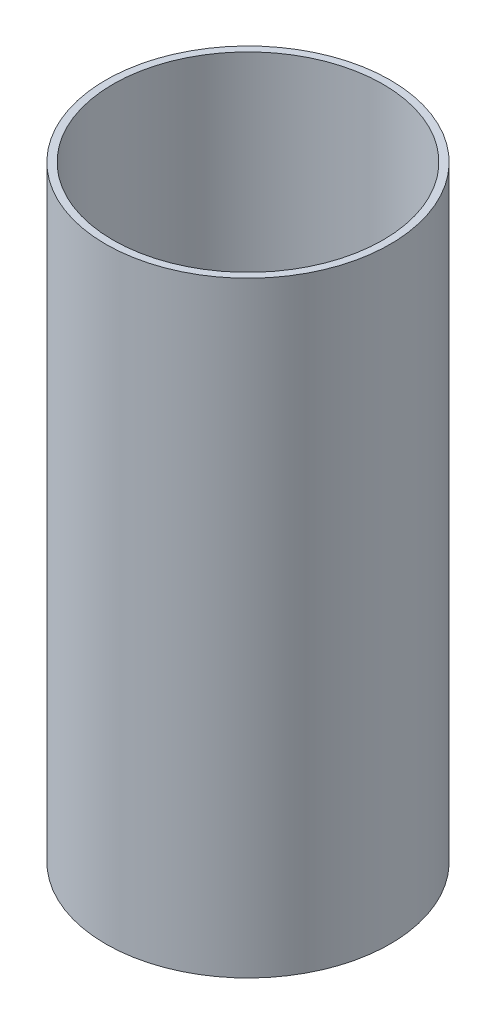
ISO-10303-21;
HEADER;
FILE_DESCRIPTION(('STEP AP214'),'2;1');
FILE_NAME('part.step','',(''),(''),'','','');
FILE_SCHEMA(('AUTOMOTIVE_DESIGN { 1 0 10303 214 1 1 1 1 }'));
ENDSEC;
DATA;
#1=APPLICATION_CONTEXT('core data for automotive mechanical design processes');
#2=APPLICATION_PROTOCOL_DEFINITION('international standard','automotive_design',2000,#1);
#3=PRODUCT_CONTEXT('',#1,'mechanical');
#4=PRODUCT('Part','Part','',(#3));
#5=PRODUCT_RELATED_PRODUCT_CATEGORY('part','',(#4));
#6=PRODUCT_DEFINITION_FORMATION('','',#4);
#7=PRODUCT_DEFINITION_CONTEXT('part definition',#1,'design');
#8=PRODUCT_DEFINITION('design','',#6,#7);
#9=PRODUCT_DEFINITION_SHAPE('','',#8);
#10=(LENGTH_UNIT() NAMED_UNIT(*) SI_UNIT(.MILLI.,.METRE.));
#11=(NAMED_UNIT(*) PLANE_ANGLE_UNIT() SI_UNIT($,.RADIAN.));
#12=(NAMED_UNIT(*) SI_UNIT($,.STERADIAN.) SOLID_ANGLE_UNIT());
#13=UNCERTAINTY_MEASURE_WITH_UNIT(LENGTH_MEASURE(1.E-05),#10,'distance_accuracy_value','');
#14=(GEOMETRIC_REPRESENTATION_CONTEXT(3) GLOBAL_UNCERTAINTY_ASSIGNED_CONTEXT((#13)) GLOBAL_UNIT_ASSIGNED_CONTEXT((#10,
#11,#12)) REPRESENTATION_CONTEXT('',''));
#15=CARTESIAN_POINT('',(0.,0.,0.));
#16=DIRECTION('',(0.,0.,1.));
#17=DIRECTION('',(1.,0.,0.));
#18=AXIS2_PLACEMENT_3D('',#15,#16,#17);
#19=CARTESIAN_POINT('',(0.,199.517,0.));
#20=DIRECTION('',(0.,1.,0.));
#21=DIRECTION('',(0.,0.,1.));
#22=AXIS2_PLACEMENT_3D('',#19,#20,#21);
#23=PLANE('',#22);
#24=CARTESIAN_POINT('',(0.,199.517,0.));
#25=DIRECTION('',(0.,1.,0.));
#26=DIRECTION('',(0.,0.,1.));
#27=AXIS2_PLACEMENT_3D('',#24,#25,#26);
#28=CIRCLE('',#27,93.6625);
#29=CARTESIAN_POINT('',(0.,199.517,93.6625));
#30=VERTEX_POINT('',#29);
#31=EDGE_CURVE('E10',#30,#30,#28,.T.);
#32=ORIENTED_EDGE('',*,*,#31,.T.);
#33=EDGE_LOOP('',(#32));
#34=FACE_BOUND('',#33,.T.);
#35=CARTESIAN_POINT('',(0.,199.517,0.));
#36=DIRECTION('',(0.,1.,0.));
#37=DIRECTION('',(0.,0.,1.));
#38=AXIS2_PLACEMENT_3D('',#35,#36,#37);
#39=CIRCLE('',#38,88.9);
#40=CARTESIAN_POINT('',(0.,199.517,88.9));
#41=VERTEX_POINT('',#40);
#42=EDGE_CURVE('E46',#41,#41,#39,.T.);
#43=ORIENTED_EDGE('',*,*,#42,.F.);
#44=EDGE_LOOP('',(#43));
#45=FACE_BOUND('',#44,.T.);
#46=ADVANCED_FACE('F35',(#34,#45),#23,.T.);
#47=CARTESIAN_POINT('',(0.,-199.517,0.));
#48=DIRECTION('',(0.,1.,0.));
#49=DIRECTION('',(0.,0.,1.));
#50=AXIS2_PLACEMENT_3D('',#47,#48,#49);
#51=PLANE('',#50);
#52=CARTESIAN_POINT('',(0.,-199.517,0.));
#53=DIRECTION('',(0.,1.,0.));
#54=DIRECTION('',(0.,0.,1.));
#55=AXIS2_PLACEMENT_3D('',#52,#53,#54);
#56=CIRCLE('',#55,93.6625);
#57=CARTESIAN_POINT('',(0.,-199.517,93.6625));
#58=VERTEX_POINT('',#57);
#59=EDGE_CURVE('E39',#58,#58,#56,.T.);
#60=ORIENTED_EDGE('',*,*,#59,.F.);
#61=EDGE_LOOP('',(#60));
#62=FACE_BOUND('',#61,.T.);
#63=CARTESIAN_POINT('',(0.,-199.517,0.));
#64=DIRECTION('',(0.,1.,0.));
#65=DIRECTION('',(0.,0.,1.));
#66=AXIS2_PLACEMENT_3D('',#63,#64,#65);
#67=CIRCLE('',#66,88.9);
#68=CARTESIAN_POINT('',(0.,-199.517,88.9));
#69=VERTEX_POINT('',#68);
#70=EDGE_CURVE('E48',#69,#69,#67,.T.);
#71=ORIENTED_EDGE('',*,*,#70,.T.);
#72=EDGE_LOOP('',(#71));
#73=FACE_BOUND('',#72,.T.);
#74=ADVANCED_FACE('F58',(#62,#73),#51,.F.);
#75=CARTESIAN_POINT('',(0.,199.517,0.));
#76=DIRECTION('',(0.,-1.,0.));
#77=DIRECTION('',(0.,0.,-1.));
#78=AXIS2_PLACEMENT_3D('',#75,#76,#77);
#79=CYLINDRICAL_SURFACE('',#78,93.6625);
#80=ORIENTED_EDGE('',*,*,#31,.F.);
#81=EDGE_LOOP('',(#80));
#82=FACE_BOUND('',#81,.T.);
#83=ORIENTED_EDGE('',*,*,#59,.T.);
#84=EDGE_LOOP('',(#83));
#85=FACE_BOUND('',#84,.T.);
#86=ADVANCED_FACE('F37',(#82,#85),#79,.T.);
#87=CARTESIAN_POINT('',(0.,199.517,0.));
#88=DIRECTION('',(0.,-1.,0.));
#89=DIRECTION('',(0.,0.,-1.));
#90=AXIS2_PLACEMENT_3D('',#87,#88,#89);
#91=CYLINDRICAL_SURFACE('',#90,88.9);
#92=ORIENTED_EDGE('',*,*,#42,.T.);
#93=EDGE_LOOP('',(#92));
#94=FACE_BOUND('',#93,.T.);
#95=ORIENTED_EDGE('',*,*,#70,.F.);
#96=EDGE_LOOP('',(#95));
#97=FACE_BOUND('',#96,.T.);
#98=ADVANCED_FACE('F54',(#94,#97),#91,.F.);
#99=CLOSED_SHELL('',(#46,#74,#86,#98));
#100=MANIFOLD_SOLID_BREP('B2',#99);
#101=ADVANCED_BREP_SHAPE_REPRESENTATION('',(#18,#100),#14);
#102=SHAPE_DEFINITION_REPRESENTATION(#9,#101);
ENDSEC;
END-ISO-10303-21;
